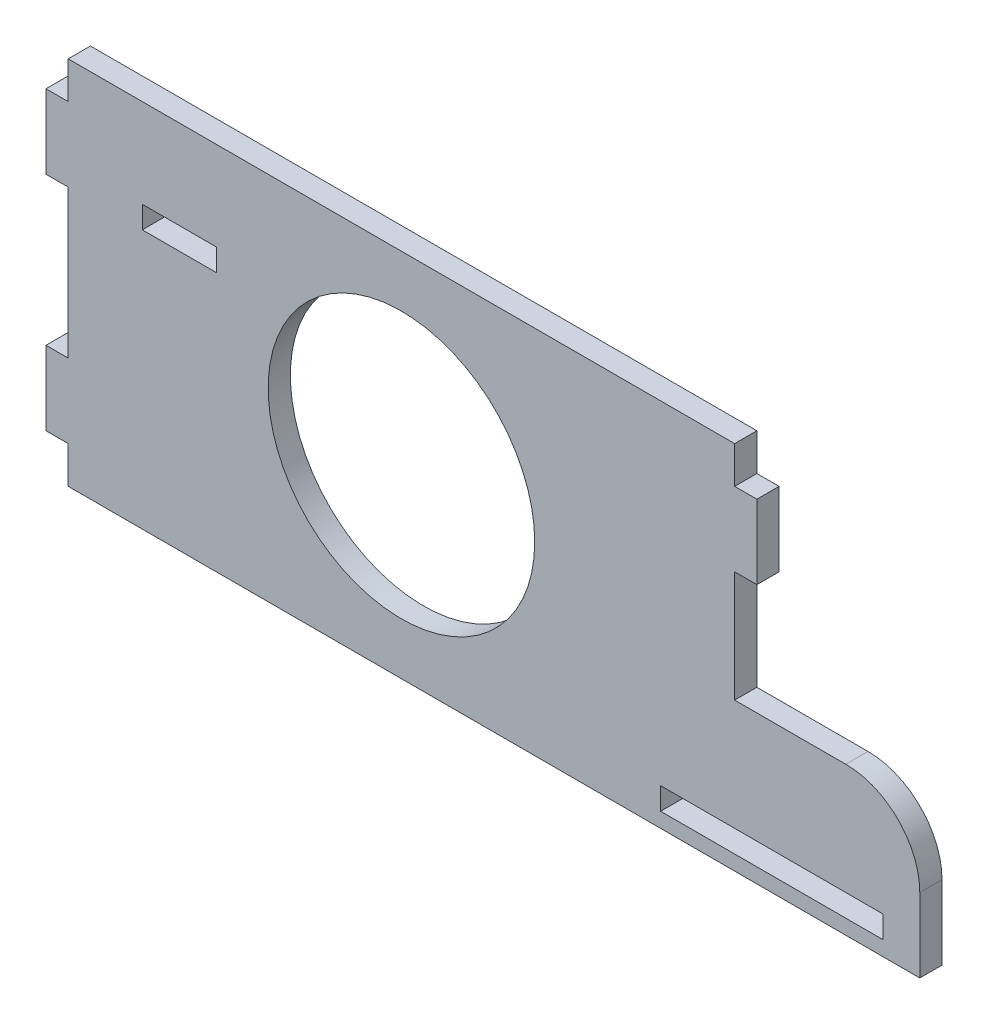
ISO-10303-21;
HEADER;
FILE_DESCRIPTION(('STEP AP214'),'2;1');
FILE_NAME('part.step','',(''),(''),'','','');
FILE_SCHEMA(('AUTOMOTIVE_DESIGN { 1 0 10303 214 1 1 1 1 }'));
ENDSEC;
DATA;
#1=APPLICATION_CONTEXT('core data for automotive mechanical design processes');
#2=APPLICATION_PROTOCOL_DEFINITION('international standard','automotive_design',2000,#1);
#3=PRODUCT_CONTEXT('',#1,'mechanical');
#4=PRODUCT('Part','Part','',(#3));
#5=PRODUCT_RELATED_PRODUCT_CATEGORY('part','',(#4));
#6=PRODUCT_DEFINITION_FORMATION('','',#4);
#7=PRODUCT_DEFINITION_CONTEXT('part definition',#1,'design');
#8=PRODUCT_DEFINITION('design','',#6,#7);
#9=PRODUCT_DEFINITION_SHAPE('','',#8);
#10=(LENGTH_UNIT() NAMED_UNIT(*) SI_UNIT(.MILLI.,.METRE.));
#11=(NAMED_UNIT(*) PLANE_ANGLE_UNIT() SI_UNIT($,.RADIAN.));
#12=(NAMED_UNIT(*) SI_UNIT($,.STERADIAN.) SOLID_ANGLE_UNIT());
#13=UNCERTAINTY_MEASURE_WITH_UNIT(LENGTH_MEASURE(1.E-05),#10,'distance_accuracy_value','');
#14=(GEOMETRIC_REPRESENTATION_CONTEXT(3) GLOBAL_UNCERTAINTY_ASSIGNED_CONTEXT((#13)) GLOBAL_UNIT_ASSIGNED_CONTEXT((#10,
#11,#12)) REPRESENTATION_CONTEXT('',''));
#15=CARTESIAN_POINT('',(0.,0.,0.));
#16=DIRECTION('',(0.,0.,1.));
#17=DIRECTION('',(1.,0.,0.));
#18=AXIS2_PLACEMENT_3D('',#15,#16,#17);
#19=CARTESIAN_POINT('',(60.,-15.,3.));
#20=DIRECTION('',(0.,0.,-1.));
#21=DIRECTION('',(-1.,0.,0.));
#22=AXIS2_PLACEMENT_3D('',#19,#20,#21);
#23=PLANE('',#22);
#24=DIRECTION('',(0.,1.,0.));
#25=VECTOR('',#24,1.);
#26=CARTESIAN_POINT('',(65.,-23.,3.));
#27=LINE('',#26,#25);
#28=CARTESIAN_POINT('',(65.,-23.,3.));
#29=VERTEX_POINT('',#28);
#30=CARTESIAN_POINT('',(65.,-20.,3.));
#31=VERTEX_POINT('',#30);
#32=EDGE_CURVE('E248',#29,#31,#27,.T.);
#33=ORIENTED_EDGE('',*,*,#32,.F.);
#34=DIRECTION('',(1.,0.,0.));
#35=VECTOR('',#34,1.);
#36=CARTESIAN_POINT('',(35.,-23.,3.));
#37=LINE('',#36,#35);
#38=CARTESIAN_POINT('',(35.,-23.,3.));
#39=VERTEX_POINT('',#38);
#40=EDGE_CURVE('E256',#39,#29,#37,.T.);
#41=ORIENTED_EDGE('',*,*,#40,.F.);
#42=DIRECTION('',(0.,-1.,0.));
#43=VECTOR('',#42,1.);
#44=CARTESIAN_POINT('',(35.,-23.,3.));
#45=LINE('',#44,#43);
#46=CARTESIAN_POINT('',(35.,-20.,3.));
#47=VERTEX_POINT('',#46);
#48=EDGE_CURVE('E253',#47,#39,#45,.T.);
#49=ORIENTED_EDGE('',*,*,#48,.F.);
#50=DIRECTION('',(-1.,0.,0.));
#51=VECTOR('',#50,1.);
#52=CARTESIAN_POINT('',(35.,-20.,3.));
#53=LINE('',#52,#51);
#54=EDGE_CURVE('E250',#31,#47,#53,.T.);
#55=ORIENTED_EDGE('',*,*,#54,.F.);
#56=EDGE_LOOP('',(#33,#41,#49,#55));
#57=FACE_BOUND('',#56,.T.);
#58=DIRECTION('',(1.,0.,0.));
#59=VECTOR('',#58,1.);
#60=CARTESIAN_POINT('',(-45.,-25.0000000000001,3.));
#61=LINE('',#60,#59);
#62=CARTESIAN_POINT('',(-45.,-25.0000000000001,3.));
#63=VERTEX_POINT('',#62);
#64=CARTESIAN_POINT('',(70.,-25.,3.));
#65=VERTEX_POINT('',#64);
#66=EDGE_CURVE('E285',#63,#65,#61,.T.);
#67=ORIENTED_EDGE('',*,*,#66,.T.);
#68=DIRECTION('',(0.,1.,0.));
#69=VECTOR('',#68,1.);
#70=CARTESIAN_POINT('',(70.,-14.9999999999999,3.));
#71=LINE('',#70,#69);
#72=CARTESIAN_POINT('',(70.,-14.9999999999999,3.));
#73=VERTEX_POINT('',#72);
#74=EDGE_CURVE('E288',#65,#73,#71,.T.);
#75=ORIENTED_EDGE('',*,*,#74,.T.);
#76=CARTESIAN_POINT('',(60.,-15.,3.));
#77=DIRECTION('',(0.,0.,1.));
#78=DIRECTION('',(-1.,0.,0.));
#79=AXIS2_PLACEMENT_3D('',#76,#77,#78);
#80=CIRCLE('',#79,10.);
#81=CARTESIAN_POINT('',(59.9999999999999,-5.,3.));
#82=VERTEX_POINT('',#81);
#83=EDGE_CURVE('E291',#73,#82,#80,.T.);
#84=ORIENTED_EDGE('',*,*,#83,.T.);
#85=DIRECTION('',(-1.,0.,0.));
#86=VECTOR('',#85,1.);
#87=CARTESIAN_POINT('',(45.,-4.99999999999989,3.));
#88=LINE('',#87,#86);
#89=CARTESIAN_POINT('',(45.,-4.99999999999989,3.));
#90=VERTEX_POINT('',#89);
#91=EDGE_CURVE('E293',#82,#90,#88,.T.);
#92=ORIENTED_EDGE('',*,*,#91,.T.);
#93=DIRECTION('',(0.,1.,0.));
#94=VECTOR('',#93,1.);
#95=CARTESIAN_POINT('',(45.,10.0000000000001,3.));
#96=LINE('',#95,#94);
#97=CARTESIAN_POINT('',(45.,10.0000000000001,3.));
#98=VERTEX_POINT('',#97);
#99=EDGE_CURVE('E295',#90,#98,#96,.T.);
#100=ORIENTED_EDGE('',*,*,#99,.T.);
#101=DIRECTION('',(1.,0.,0.));
#102=VECTOR('',#101,1.);
#103=CARTESIAN_POINT('',(45.,10.0000000000001,3.));
#104=LINE('',#103,#102);
#105=CARTESIAN_POINT('',(48.0000000000001,10.0000000000001,3.));
#106=VERTEX_POINT('',#105);
#107=EDGE_CURVE('E297',#98,#106,#104,.T.);
#108=ORIENTED_EDGE('',*,*,#107,.T.);
#109=DIRECTION('',(0.,1.,0.));
#110=VECTOR('',#109,1.);
#111=CARTESIAN_POINT('',(48.,20.,3.));
#112=LINE('',#111,#110);
#113=CARTESIAN_POINT('',(48.,20.,3.));
#114=VERTEX_POINT('',#113);
#115=EDGE_CURVE('E299',#106,#114,#112,.T.);
#116=ORIENTED_EDGE('',*,*,#115,.T.);
#117=DIRECTION('',(-1.,0.,0.));
#118=VECTOR('',#117,1.);
#119=CARTESIAN_POINT('',(45.,20.,3.));
#120=LINE('',#119,#118);
#121=CARTESIAN_POINT('',(45.,20.,3.));
#122=VERTEX_POINT('',#121);
#123=EDGE_CURVE('E301',#114,#122,#120,.T.);
#124=ORIENTED_EDGE('',*,*,#123,.T.);
#125=DIRECTION('',(0.,1.,0.));
#126=VECTOR('',#125,1.);
#127=CARTESIAN_POINT('',(45.,25.,3.));
#128=LINE('',#127,#126);
#129=CARTESIAN_POINT('',(45.,25.,3.));
#130=VERTEX_POINT('',#129);
#131=EDGE_CURVE('E303',#122,#130,#128,.T.);
#132=ORIENTED_EDGE('',*,*,#131,.T.);
#133=DIRECTION('',(-1.,0.,0.));
#134=VECTOR('',#133,1.);
#135=CARTESIAN_POINT('',(45.,25.,3.));
#136=LINE('',#135,#134);
#137=CARTESIAN_POINT('',(-45.,24.9999999999999,3.));
#138=VERTEX_POINT('',#137);
#139=EDGE_CURVE('E305',#130,#138,#136,.T.);
#140=ORIENTED_EDGE('',*,*,#139,.T.);
#141=DIRECTION('',(0.,-1.,0.));
#142=VECTOR('',#141,1.);
#143=CARTESIAN_POINT('',(-45.,24.9999999999999,3.));
#144=LINE('',#143,#142);
#145=CARTESIAN_POINT('',(-45.,20.,3.));
#146=VERTEX_POINT('',#145);
#147=EDGE_CURVE('E307',#138,#146,#144,.T.);
#148=ORIENTED_EDGE('',*,*,#147,.T.);
#149=DIRECTION('',(-1.,0.,0.));
#150=VECTOR('',#149,1.);
#151=CARTESIAN_POINT('',(-48.,20.,3.));
#152=LINE('',#151,#150);
#153=CARTESIAN_POINT('',(-48.,20.,3.));
#154=VERTEX_POINT('',#153);
#155=EDGE_CURVE('E309',#146,#154,#152,.T.);
#156=ORIENTED_EDGE('',*,*,#155,.T.);
#157=DIRECTION('',(0.,-1.,0.));
#158=VECTOR('',#157,1.);
#159=CARTESIAN_POINT('',(-48.,20.,3.));
#160=LINE('',#159,#158);
#161=CARTESIAN_POINT('',(-48.,10.,3.));
#162=VERTEX_POINT('',#161);
#163=EDGE_CURVE('E311',#154,#162,#160,.T.);
#164=ORIENTED_EDGE('',*,*,#163,.T.);
#165=DIRECTION('',(1.,0.,0.));
#166=VECTOR('',#165,1.);
#167=CARTESIAN_POINT('',(-48.,10.,3.));
#168=LINE('',#167,#166);
#169=CARTESIAN_POINT('',(-45.,10.,3.));
#170=VERTEX_POINT('',#169);
#171=EDGE_CURVE('E313',#162,#170,#168,.T.);
#172=ORIENTED_EDGE('',*,*,#171,.T.);
#173=DIRECTION('',(0.,-1.,0.));
#174=VECTOR('',#173,1.);
#175=CARTESIAN_POINT('',(-45.,10.,3.));
#176=LINE('',#175,#174);
#177=CARTESIAN_POINT('',(-45.,-10.,3.));
#178=VERTEX_POINT('',#177);
#179=EDGE_CURVE('E315',#170,#178,#176,.T.);
#180=ORIENTED_EDGE('',*,*,#179,.T.);
#181=DIRECTION('',(-1.,0.,0.));
#182=VECTOR('',#181,1.);
#183=CARTESIAN_POINT('',(-48.,-10.,3.));
#184=LINE('',#183,#182);
#185=CARTESIAN_POINT('',(-48.,-10.,3.));
#186=VERTEX_POINT('',#185);
#187=EDGE_CURVE('E317',#178,#186,#184,.T.);
#188=ORIENTED_EDGE('',*,*,#187,.T.);
#189=DIRECTION('',(0.,-1.,0.));
#190=VECTOR('',#189,1.);
#191=CARTESIAN_POINT('',(-48.,-10.,3.));
#192=LINE('',#191,#190);
#193=CARTESIAN_POINT('',(-48.,-20.,3.));
#194=VERTEX_POINT('',#193);
#195=EDGE_CURVE('E319',#186,#194,#192,.T.);
#196=ORIENTED_EDGE('',*,*,#195,.T.);
#197=DIRECTION('',(1.,0.,0.));
#198=VECTOR('',#197,1.);
#199=CARTESIAN_POINT('',(-48.,-20.,3.));
#200=LINE('',#199,#198);
#201=CARTESIAN_POINT('',(-45.,-20.,3.));
#202=VERTEX_POINT('',#201);
#203=EDGE_CURVE('E321',#194,#202,#200,.T.);
#204=ORIENTED_EDGE('',*,*,#203,.T.);
#205=DIRECTION('',(0.,-1.,0.));
#206=VECTOR('',#205,1.);
#207=CARTESIAN_POINT('',(-45.,-20.,3.));
#208=LINE('',#207,#206);
#209=EDGE_CURVE('E323',#202,#63,#208,.T.);
#210=ORIENTED_EDGE('',*,*,#209,.T.);
#211=EDGE_LOOP('',(#67,#75,#84,#92,#100,#108,#116,#124,#132,#140,#148,#156,#164,#172,#180,#188,
#196,#204,#210));
#212=FACE_BOUND('',#211,.T.);
#213=CARTESIAN_POINT('',(0.,0.,3.));
#214=DIRECTION('',(0.,0.,1.));
#215=DIRECTION('',(1.,0.,0.));
#216=AXIS2_PLACEMENT_3D('',#213,#214,#215);
#217=CIRCLE('',#216,18.);
#218=CARTESIAN_POINT('',(18.,0.,3.));
#219=VERTEX_POINT('',#218);
#220=EDGE_CURVE('E279',#219,#219,#217,.T.);
#221=ORIENTED_EDGE('',*,*,#220,.F.);
#222=EDGE_LOOP('',(#221));
#223=FACE_BOUND('',#222,.T.);
#224=DIRECTION('',(0.,1.,0.));
#225=VECTOR('',#224,1.);
#226=CARTESIAN_POINT('',(-25.,13.,3.));
#227=LINE('',#226,#225);
#228=CARTESIAN_POINT('',(-25.,10.,3.));
#229=VERTEX_POINT('',#228);
#230=CARTESIAN_POINT('',(-25.,13.,3.));
#231=VERTEX_POINT('',#230);
#232=EDGE_CURVE('E212',#229,#231,#227,.T.);
#233=ORIENTED_EDGE('',*,*,#232,.F.);
#234=DIRECTION('',(1.,0.,0.));
#235=VECTOR('',#234,1.);
#236=CARTESIAN_POINT('',(-35.,10.,3.));
#237=LINE('',#236,#235);
#238=CARTESIAN_POINT('',(-35.,10.,3.));
#239=VERTEX_POINT('',#238);
#240=EDGE_CURVE('E234',#239,#229,#237,.T.);
#241=ORIENTED_EDGE('',*,*,#240,.F.);
#242=DIRECTION('',(0.,-1.,0.));
#243=VECTOR('',#242,1.);
#244=CARTESIAN_POINT('',(-35.,13.,3.));
#245=LINE('',#244,#243);
#246=CARTESIAN_POINT('',(-35.,13.,3.));
#247=VERTEX_POINT('',#246);
#248=EDGE_CURVE('E232',#247,#239,#245,.T.);
#249=ORIENTED_EDGE('',*,*,#248,.F.);
#250=DIRECTION('',(-1.,0.,0.));
#251=VECTOR('',#250,1.);
#252=CARTESIAN_POINT('',(-35.,13.,3.));
#253=LINE('',#252,#251);
#254=EDGE_CURVE('E220',#231,#247,#253,.T.);
#255=ORIENTED_EDGE('',*,*,#254,.F.);
#256=EDGE_LOOP('',(#233,#241,#249,#255));
#257=FACE_BOUND('',#256,.T.);
#258=ADVANCED_FACE('F33',(#57,#212,#223,#257),#23,.F.);
#259=CARTESIAN_POINT('',(60.,-15.,0.));
#260=DIRECTION('',(0.,0.,-1.));
#261=DIRECTION('',(-1.,0.,0.));
#262=AXIS2_PLACEMENT_3D('',#259,#260,#261);
#263=PLANE('',#262);
#264=DIRECTION('',(1.,0.,0.));
#265=VECTOR('',#264,1.);
#266=CARTESIAN_POINT('',(-45.,-25.0000000000001,0.));
#267=LINE('',#266,#265);
#268=CARTESIAN_POINT('',(-45.,-25.0000000000001,0.));
#269=VERTEX_POINT('',#268);
#270=CARTESIAN_POINT('',(70.,-25.,0.));
#271=VERTEX_POINT('',#270);
#272=EDGE_CURVE('E282',#269,#271,#267,.T.);
#273=ORIENTED_EDGE('',*,*,#272,.F.);
#274=DIRECTION('',(0.,-1.,0.));
#275=VECTOR('',#274,1.);
#276=CARTESIAN_POINT('',(-45.,-20.,0.));
#277=LINE('',#276,#275);
#278=CARTESIAN_POINT('',(-45.,-20.,0.));
#279=VERTEX_POINT('',#278);
#280=EDGE_CURVE('E289',#279,#269,#277,.T.);
#281=ORIENTED_EDGE('',*,*,#280,.F.);
#282=DIRECTION('',(1.,0.,0.));
#283=VECTOR('',#282,1.);
#284=CARTESIAN_POINT('',(-48.,-20.,0.));
#285=LINE('',#284,#283);
#286=CARTESIAN_POINT('',(-48.,-20.,0.));
#287=VERTEX_POINT('',#286);
#288=EDGE_CURVE('E360',#287,#279,#285,.T.);
#289=ORIENTED_EDGE('',*,*,#288,.F.);
#290=DIRECTION('',(0.,-1.,0.));
#291=VECTOR('',#290,1.);
#292=CARTESIAN_POINT('',(-48.,-10.,0.));
#293=LINE('',#292,#291);
#294=CARTESIAN_POINT('',(-48.,-10.,0.));
#295=VERTEX_POINT('',#294);
#296=EDGE_CURVE('E358',#295,#287,#293,.T.);
#297=ORIENTED_EDGE('',*,*,#296,.F.);
#298=DIRECTION('',(-1.,0.,0.));
#299=VECTOR('',#298,1.);
#300=CARTESIAN_POINT('',(-48.,-10.,0.));
#301=LINE('',#300,#299);
#302=CARTESIAN_POINT('',(-45.,-10.,0.));
#303=VERTEX_POINT('',#302);
#304=EDGE_CURVE('E356',#303,#295,#301,.T.);
#305=ORIENTED_EDGE('',*,*,#304,.F.);
#306=DIRECTION('',(0.,-1.,0.));
#307=VECTOR('',#306,1.);
#308=CARTESIAN_POINT('',(-45.,10.,0.));
#309=LINE('',#308,#307);
#310=CARTESIAN_POINT('',(-45.,10.,0.));
#311=VERTEX_POINT('',#310);
#312=EDGE_CURVE('E354',#311,#303,#309,.T.);
#313=ORIENTED_EDGE('',*,*,#312,.F.);
#314=DIRECTION('',(1.,0.,0.));
#315=VECTOR('',#314,1.);
#316=CARTESIAN_POINT('',(-48.,10.,0.));
#317=LINE('',#316,#315);
#318=CARTESIAN_POINT('',(-48.,10.,0.));
#319=VERTEX_POINT('',#318);
#320=EDGE_CURVE('E352',#319,#311,#317,.T.);
#321=ORIENTED_EDGE('',*,*,#320,.F.);
#322=DIRECTION('',(0.,-1.,0.));
#323=VECTOR('',#322,1.);
#324=CARTESIAN_POINT('',(-48.,20.,0.));
#325=LINE('',#324,#323);
#326=CARTESIAN_POINT('',(-48.,20.,0.));
#327=VERTEX_POINT('',#326);
#328=EDGE_CURVE('E350',#327,#319,#325,.T.);
#329=ORIENTED_EDGE('',*,*,#328,.F.);
#330=DIRECTION('',(-1.,0.,0.));
#331=VECTOR('',#330,1.);
#332=CARTESIAN_POINT('',(-48.,20.,0.));
#333=LINE('',#332,#331);
#334=CARTESIAN_POINT('',(-45.,20.,0.));
#335=VERTEX_POINT('',#334);
#336=EDGE_CURVE('E348',#335,#327,#333,.T.);
#337=ORIENTED_EDGE('',*,*,#336,.F.);
#338=DIRECTION('',(0.,-1.,0.));
#339=VECTOR('',#338,1.);
#340=CARTESIAN_POINT('',(-45.,24.9999999999999,0.));
#341=LINE('',#340,#339);
#342=CARTESIAN_POINT('',(-45.,24.9999999999999,0.));
#343=VERTEX_POINT('',#342);
#344=EDGE_CURVE('E346',#343,#335,#341,.T.);
#345=ORIENTED_EDGE('',*,*,#344,.F.);
#346=DIRECTION('',(-1.,0.,0.));
#347=VECTOR('',#346,1.);
#348=CARTESIAN_POINT('',(45.,25.,0.));
#349=LINE('',#348,#347);
#350=CARTESIAN_POINT('',(45.,25.,0.));
#351=VERTEX_POINT('',#350);
#352=EDGE_CURVE('E344',#351,#343,#349,.T.);
#353=ORIENTED_EDGE('',*,*,#352,.F.);
#354=DIRECTION('',(0.,1.,0.));
#355=VECTOR('',#354,1.);
#356=CARTESIAN_POINT('',(45.,25.,0.));
#357=LINE('',#356,#355);
#358=CARTESIAN_POINT('',(45.,20.,0.));
#359=VERTEX_POINT('',#358);
#360=EDGE_CURVE('E342',#359,#351,#357,.T.);
#361=ORIENTED_EDGE('',*,*,#360,.F.);
#362=DIRECTION('',(-1.,0.,0.));
#363=VECTOR('',#362,1.);
#364=CARTESIAN_POINT('',(45.,20.,0.));
#365=LINE('',#364,#363);
#366=CARTESIAN_POINT('',(48.,20.,0.));
#367=VERTEX_POINT('',#366);
#368=EDGE_CURVE('E340',#367,#359,#365,.T.);
#369=ORIENTED_EDGE('',*,*,#368,.F.);
#370=DIRECTION('',(0.,1.,0.));
#371=VECTOR('',#370,1.);
#372=CARTESIAN_POINT('',(48.,20.,0.));
#373=LINE('',#372,#371);
#374=CARTESIAN_POINT('',(48.0000000000001,10.0000000000001,0.));
#375=VERTEX_POINT('',#374);
#376=EDGE_CURVE('E338',#375,#367,#373,.T.);
#377=ORIENTED_EDGE('',*,*,#376,.F.);
#378=DIRECTION('',(1.,0.,0.));
#379=VECTOR('',#378,1.);
#380=CARTESIAN_POINT('',(45.,10.0000000000001,0.));
#381=LINE('',#380,#379);
#382=CARTESIAN_POINT('',(45.,10.0000000000001,0.));
#383=VERTEX_POINT('',#382);
#384=EDGE_CURVE('E336',#383,#375,#381,.T.);
#385=ORIENTED_EDGE('',*,*,#384,.F.);
#386=DIRECTION('',(0.,1.,0.));
#387=VECTOR('',#386,1.);
#388=CARTESIAN_POINT('',(45.,10.0000000000001,0.));
#389=LINE('',#388,#387);
#390=CARTESIAN_POINT('',(45.,-4.99999999999989,0.));
#391=VERTEX_POINT('',#390);
#392=EDGE_CURVE('E334',#391,#383,#389,.T.);
#393=ORIENTED_EDGE('',*,*,#392,.F.);
#394=DIRECTION('',(-1.,0.,0.));
#395=VECTOR('',#394,1.);
#396=CARTESIAN_POINT('',(45.,-4.99999999999989,0.));
#397=LINE('',#396,#395);
#398=CARTESIAN_POINT('',(59.9999999999999,-5.,0.));
#399=VERTEX_POINT('',#398);
#400=EDGE_CURVE('E332',#399,#391,#397,.T.);
#401=ORIENTED_EDGE('',*,*,#400,.F.);
#402=CARTESIAN_POINT('',(60.,-15.,0.));
#403=DIRECTION('',(0.,0.,1.));
#404=DIRECTION('',(-1.,0.,0.));
#405=AXIS2_PLACEMENT_3D('',#402,#403,#404);
#406=CIRCLE('',#405,10.);
#407=CARTESIAN_POINT('',(70.,-14.9999999999999,0.));
#408=VERTEX_POINT('',#407);
#409=EDGE_CURVE('E330',#408,#399,#406,.T.);
#410=ORIENTED_EDGE('',*,*,#409,.F.);
#411=DIRECTION('',(0.,1.,0.));
#412=VECTOR('',#411,1.);
#413=CARTESIAN_POINT('',(70.,-14.9999999999999,0.));
#414=LINE('',#413,#412);
#415=EDGE_CURVE('E328',#271,#408,#414,.T.);
#416=ORIENTED_EDGE('',*,*,#415,.F.);
#417=EDGE_LOOP('',(#273,#281,#289,#297,#305,#313,#321,#329,#337,#345,#353,#361,#369,#377,#385,
#393,#401,#410,#416));
#418=FACE_BOUND('',#417,.T.);
#419=CARTESIAN_POINT('',(0.,0.,0.));
#420=DIRECTION('',(0.,0.,1.));
#421=DIRECTION('',(1.,0.,0.));
#422=AXIS2_PLACEMENT_3D('',#419,#420,#421);
#423=CIRCLE('',#422,18.);
#424=CARTESIAN_POINT('',(18.,0.,0.));
#425=VERTEX_POINT('',#424);
#426=EDGE_CURVE('E278',#425,#425,#423,.T.);
#427=ORIENTED_EDGE('',*,*,#426,.T.);
#428=EDGE_LOOP('',(#427));
#429=FACE_BOUND('',#428,.T.);
#430=DIRECTION('',(1.,0.,0.));
#431=VECTOR('',#430,1.);
#432=CARTESIAN_POINT('',(35.,-23.,0.));
#433=LINE('',#432,#431);
#434=CARTESIAN_POINT('',(35.,-23.,0.));
#435=VERTEX_POINT('',#434);
#436=CARTESIAN_POINT('',(65.,-23.,0.));
#437=VERTEX_POINT('',#436);
#438=EDGE_CURVE('E251',#435,#437,#433,.T.);
#439=ORIENTED_EDGE('',*,*,#438,.T.);
#440=DIRECTION('',(0.,1.,0.));
#441=VECTOR('',#440,1.);
#442=CARTESIAN_POINT('',(65.,-23.,0.));
#443=LINE('',#442,#441);
#444=CARTESIAN_POINT('',(65.,-20.,0.));
#445=VERTEX_POINT('',#444);
#446=EDGE_CURVE('E228',#437,#445,#443,.T.);
#447=ORIENTED_EDGE('',*,*,#446,.T.);
#448=DIRECTION('',(-1.,0.,0.));
#449=VECTOR('',#448,1.);
#450=CARTESIAN_POINT('',(35.,-20.,0.));
#451=LINE('',#450,#449);
#452=CARTESIAN_POINT('',(35.,-20.,0.));
#453=VERTEX_POINT('',#452);
#454=EDGE_CURVE('E261',#445,#453,#451,.T.);
#455=ORIENTED_EDGE('',*,*,#454,.T.);
#456=DIRECTION('',(0.,-1.,0.));
#457=VECTOR('',#456,1.);
#458=CARTESIAN_POINT('',(35.,-23.,0.));
#459=LINE('',#458,#457);
#460=EDGE_CURVE('E264',#453,#435,#459,.T.);
#461=ORIENTED_EDGE('',*,*,#460,.T.);
#462=EDGE_LOOP('',(#439,#447,#455,#461));
#463=FACE_BOUND('',#462,.T.);
#464=DIRECTION('',(1.,0.,0.));
#465=VECTOR('',#464,1.);
#466=CARTESIAN_POINT('',(-35.,10.,0.));
#467=LINE('',#466,#465);
#468=CARTESIAN_POINT('',(-35.,10.,0.));
#469=VERTEX_POINT('',#468);
#470=CARTESIAN_POINT('',(-25.,10.,0.));
#471=VERTEX_POINT('',#470);
#472=EDGE_CURVE('E221',#469,#471,#467,.T.);
#473=ORIENTED_EDGE('',*,*,#472,.T.);
#474=DIRECTION('',(0.,1.,0.));
#475=VECTOR('',#474,1.);
#476=CARTESIAN_POINT('',(-25.,13.,0.));
#477=LINE('',#476,#475);
#478=CARTESIAN_POINT('',(-25.,13.,0.));
#479=VERTEX_POINT('',#478);
#480=EDGE_CURVE('E56',#471,#479,#477,.T.);
#481=ORIENTED_EDGE('',*,*,#480,.T.);
#482=DIRECTION('',(-1.,0.,0.));
#483=VECTOR('',#482,1.);
#484=CARTESIAN_POINT('',(-35.,13.,0.));
#485=LINE('',#484,#483);
#486=CARTESIAN_POINT('',(-35.,13.,0.));
#487=VERTEX_POINT('',#486);
#488=EDGE_CURVE('E227',#479,#487,#485,.T.);
#489=ORIENTED_EDGE('',*,*,#488,.T.);
#490=DIRECTION('',(0.,-1.,0.));
#491=VECTOR('',#490,1.);
#492=CARTESIAN_POINT('',(-35.,13.,0.));
#493=LINE('',#492,#491);
#494=EDGE_CURVE('E240',#487,#469,#493,.T.);
#495=ORIENTED_EDGE('',*,*,#494,.T.);
#496=EDGE_LOOP('',(#473,#481,#489,#495));
#497=FACE_BOUND('',#496,.T.);
#498=ADVANCED_FACE('F423',(#418,#429,#463,#497),#263,.T.);
#499=CARTESIAN_POINT('',(-45.,-25.0000000000001,3.));
#500=DIRECTION('',(0.,1.,0.));
#501=DIRECTION('',(-1.,0.,0.));
#502=AXIS2_PLACEMENT_3D('',#499,#500,#501);
#503=PLANE('',#502);
#504=ORIENTED_EDGE('',*,*,#272,.T.);
#505=DIRECTION('',(0.,0.,-1.));
#506=VECTOR('',#505,1.);
#507=CARTESIAN_POINT('',(70.,-25.,3.));
#508=LINE('',#507,#506);
#509=EDGE_CURVE('E11',#65,#271,#508,.T.);
#510=ORIENTED_EDGE('',*,*,#509,.F.);
#511=ORIENTED_EDGE('',*,*,#66,.F.);
#512=DIRECTION('',(0.,0.,-1.));
#513=VECTOR('',#512,1.);
#514=CARTESIAN_POINT('',(-45.,-25.0000000000001,3.));
#515=LINE('',#514,#513);
#516=EDGE_CURVE('E325',#63,#269,#515,.T.);
#517=ORIENTED_EDGE('',*,*,#516,.T.);
#518=EDGE_LOOP('',(#504,#510,#511,#517));
#519=FACE_BOUND('',#518,.T.);
#520=ADVANCED_FACE('F35',(#519),#503,.F.);
#521=CARTESIAN_POINT('',(70.,-14.9999999999999,3.));
#522=DIRECTION('',(-1.,0.,0.));
#523=DIRECTION('',(0.,-1.,0.));
#524=AXIS2_PLACEMENT_3D('',#521,#522,#523);
#525=PLANE('',#524);
#526=ORIENTED_EDGE('',*,*,#415,.T.);
#527=DIRECTION('',(0.,0.,-1.));
#528=VECTOR('',#527,1.);
#529=CARTESIAN_POINT('',(70.,-14.9999999999999,3.));
#530=LINE('',#529,#528);
#531=EDGE_CURVE('E41',#73,#408,#530,.T.);
#532=ORIENTED_EDGE('',*,*,#531,.F.);
#533=ORIENTED_EDGE('',*,*,#74,.F.);
#534=ORIENTED_EDGE('',*,*,#509,.T.);
#535=EDGE_LOOP('',(#526,#532,#533,#534));
#536=FACE_BOUND('',#535,.T.);
#537=ADVANCED_FACE('F441',(#536),#525,.F.);
#538=CARTESIAN_POINT('',(60.,-15.,3.));
#539=DIRECTION('',(0.,0.,-1.));
#540=DIRECTION('',(-1.,0.,0.));
#541=AXIS2_PLACEMENT_3D('',#538,#539,#540);
#542=CYLINDRICAL_SURFACE('',#541,10.);
#543=ORIENTED_EDGE('',*,*,#409,.T.);
#544=DIRECTION('',(0.,0.,-1.));
#545=VECTOR('',#544,1.);
#546=CARTESIAN_POINT('',(59.9999999999999,-5.,3.));
#547=LINE('',#546,#545);
#548=EDGE_CURVE('E410',#82,#399,#547,.T.);
#549=ORIENTED_EDGE('',*,*,#548,.F.);
#550=ORIENTED_EDGE('',*,*,#83,.F.);
#551=ORIENTED_EDGE('',*,*,#531,.T.);
#552=EDGE_LOOP('',(#543,#549,#550,#551));
#553=FACE_BOUND('',#552,.T.);
#554=ADVANCED_FACE('F417',(#553),#542,.T.);
#555=CARTESIAN_POINT('',(45.,-4.99999999999989,3.));
#556=DIRECTION('',(0.,-1.,0.));
#557=DIRECTION('',(1.,0.,0.));
#558=AXIS2_PLACEMENT_3D('',#555,#556,#557);
#559=PLANE('',#558);
#560=ORIENTED_EDGE('',*,*,#400,.T.);
#561=DIRECTION('',(0.,0.,-1.));
#562=VECTOR('',#561,1.);
#563=CARTESIAN_POINT('',(45.,-4.99999999999989,3.));
#564=LINE('',#563,#562);
#565=EDGE_CURVE('E407',#90,#391,#564,.T.);
#566=ORIENTED_EDGE('',*,*,#565,.F.);
#567=ORIENTED_EDGE('',*,*,#91,.F.);
#568=ORIENTED_EDGE('',*,*,#548,.T.);
#569=EDGE_LOOP('',(#560,#566,#567,#568));
#570=FACE_BOUND('',#569,.T.);
#571=ADVANCED_FACE('F429',(#570),#559,.F.);
#572=CARTESIAN_POINT('',(45.,10.0000000000001,3.));
#573=DIRECTION('',(-1.,0.,0.));
#574=DIRECTION('',(0.,0.,1.));
#575=AXIS2_PLACEMENT_3D('',#572,#573,#574);
#576=PLANE('',#575);
#577=ORIENTED_EDGE('',*,*,#392,.T.);
#578=DIRECTION('',(0.,0.,-1.));
#579=VECTOR('',#578,1.);
#580=CARTESIAN_POINT('',(45.,10.0000000000001,3.));
#581=LINE('',#580,#579);
#582=EDGE_CURVE('E404',#98,#383,#581,.T.);
#583=ORIENTED_EDGE('',*,*,#582,.F.);
#584=ORIENTED_EDGE('',*,*,#99,.F.);
#585=ORIENTED_EDGE('',*,*,#565,.T.);
#586=EDGE_LOOP('',(#577,#583,#584,#585));
#587=FACE_BOUND('',#586,.T.);
#588=ADVANCED_FACE('F433',(#587),#576,.F.);
#589=CARTESIAN_POINT('',(45.,10.0000000000001,3.));
#590=DIRECTION('',(0.,1.,0.));
#591=DIRECTION('',(-1.,0.,0.));
#592=AXIS2_PLACEMENT_3D('',#589,#590,#591);
#593=PLANE('',#592);
#594=ORIENTED_EDGE('',*,*,#384,.T.);
#595=DIRECTION('',(0.,0.,-1.));
#596=VECTOR('',#595,1.);
#597=CARTESIAN_POINT('',(48.0000000000001,10.0000000000001,3.));
#598=LINE('',#597,#596);
#599=EDGE_CURVE('E401',#106,#375,#598,.T.);
#600=ORIENTED_EDGE('',*,*,#599,.F.);
#601=ORIENTED_EDGE('',*,*,#107,.F.);
#602=ORIENTED_EDGE('',*,*,#582,.T.);
#603=EDGE_LOOP('',(#594,#600,#601,#602));
#604=FACE_BOUND('',#603,.T.);
#605=ADVANCED_FACE('F509',(#604),#593,.F.);
#606=CARTESIAN_POINT('',(48.,20.,3.));
#607=DIRECTION('',(-1.,0.,0.));
#608=DIRECTION('',(0.,-1.,0.));
#609=AXIS2_PLACEMENT_3D('',#606,#607,#608);
#610=PLANE('',#609);
#611=ORIENTED_EDGE('',*,*,#376,.T.);
#612=DIRECTION('',(0.,0.,-1.));
#613=VECTOR('',#612,1.);
#614=CARTESIAN_POINT('',(48.,20.,3.));
#615=LINE('',#614,#613);
#616=EDGE_CURVE('E398',#114,#367,#615,.T.);
#617=ORIENTED_EDGE('',*,*,#616,.F.);
#618=ORIENTED_EDGE('',*,*,#115,.F.);
#619=ORIENTED_EDGE('',*,*,#599,.T.);
#620=EDGE_LOOP('',(#611,#617,#618,#619));
#621=FACE_BOUND('',#620,.T.);
#622=ADVANCED_FACE('F506',(#621),#610,.F.);
#623=CARTESIAN_POINT('',(45.,20.,3.));
#624=DIRECTION('',(0.,-1.,0.));
#625=DIRECTION('',(0.,0.,-1.));
#626=AXIS2_PLACEMENT_3D('',#623,#624,#625);
#627=PLANE('',#626);
#628=ORIENTED_EDGE('',*,*,#368,.T.);
#629=DIRECTION('',(0.,0.,-1.));
#630=VECTOR('',#629,1.);
#631=CARTESIAN_POINT('',(45.,20.,3.));
#632=LINE('',#631,#630);
#633=EDGE_CURVE('E395',#122,#359,#632,.T.);
#634=ORIENTED_EDGE('',*,*,#633,.F.);
#635=ORIENTED_EDGE('',*,*,#123,.F.);
#636=ORIENTED_EDGE('',*,*,#616,.T.);
#637=EDGE_LOOP('',(#628,#634,#635,#636));
#638=FACE_BOUND('',#637,.T.);
#639=ADVANCED_FACE('F502',(#638),#627,.F.);
#640=CARTESIAN_POINT('',(45.,25.,3.));
#641=DIRECTION('',(-1.,0.,0.));
#642=DIRECTION('',(0.,0.,1.));
#643=AXIS2_PLACEMENT_3D('',#640,#641,#642);
#644=PLANE('',#643);
#645=ORIENTED_EDGE('',*,*,#360,.T.);
#646=DIRECTION('',(0.,0.,-1.));
#647=VECTOR('',#646,1.);
#648=CARTESIAN_POINT('',(45.,25.,3.));
#649=LINE('',#648,#647);
#650=EDGE_CURVE('E392',#130,#351,#649,.T.);
#651=ORIENTED_EDGE('',*,*,#650,.F.);
#652=ORIENTED_EDGE('',*,*,#131,.F.);
#653=ORIENTED_EDGE('',*,*,#633,.T.);
#654=EDGE_LOOP('',(#645,#651,#652,#653));
#655=FACE_BOUND('',#654,.T.);
#656=ADVANCED_FACE('F498',(#655),#644,.F.);
#657=CARTESIAN_POINT('',(45.,25.,3.));
#658=DIRECTION('',(0.,-1.,0.));
#659=DIRECTION('',(1.,0.,0.));
#660=AXIS2_PLACEMENT_3D('',#657,#658,#659);
#661=PLANE('',#660);
#662=ORIENTED_EDGE('',*,*,#352,.T.);
#663=DIRECTION('',(0.,0.,-1.));
#664=VECTOR('',#663,1.);
#665=CARTESIAN_POINT('',(-45.,24.9999999999999,3.));
#666=LINE('',#665,#664);
#667=EDGE_CURVE('E389',#138,#343,#666,.T.);
#668=ORIENTED_EDGE('',*,*,#667,.F.);
#669=ORIENTED_EDGE('',*,*,#139,.F.);
#670=ORIENTED_EDGE('',*,*,#650,.T.);
#671=EDGE_LOOP('',(#662,#668,#669,#670));
#672=FACE_BOUND('',#671,.T.);
#673=ADVANCED_FACE('F493',(#672),#661,.F.);
#674=CARTESIAN_POINT('',(-45.,24.9999999999999,3.));
#675=DIRECTION('',(1.,0.,0.));
#676=DIRECTION('',(0.,0.,-1.));
#677=AXIS2_PLACEMENT_3D('',#674,#675,#676);
#678=PLANE('',#677);
#679=ORIENTED_EDGE('',*,*,#344,.T.);
#680=DIRECTION('',(0.,0.,-1.));
#681=VECTOR('',#680,1.);
#682=CARTESIAN_POINT('',(-45.,20.,3.));
#683=LINE('',#682,#681);
#684=EDGE_CURVE('E386',#146,#335,#683,.T.);
#685=ORIENTED_EDGE('',*,*,#684,.F.);
#686=ORIENTED_EDGE('',*,*,#147,.F.);
#687=ORIENTED_EDGE('',*,*,#667,.T.);
#688=EDGE_LOOP('',(#679,#685,#686,#687));
#689=FACE_BOUND('',#688,.T.);
#690=ADVANCED_FACE('F487',(#689),#678,.F.);
#691=CARTESIAN_POINT('',(-48.,20.,3.));
#692=DIRECTION('',(0.,-1.,0.));
#693=DIRECTION('',(0.,0.,-1.));
#694=AXIS2_PLACEMENT_3D('',#691,#692,#693);
#695=PLANE('',#694);
#696=ORIENTED_EDGE('',*,*,#336,.T.);
#697=DIRECTION('',(0.,0.,-1.));
#698=VECTOR('',#697,1.);
#699=CARTESIAN_POINT('',(-48.,20.,3.));
#700=LINE('',#699,#698);
#701=EDGE_CURVE('E383',#154,#327,#700,.T.);
#702=ORIENTED_EDGE('',*,*,#701,.F.);
#703=ORIENTED_EDGE('',*,*,#155,.F.);
#704=ORIENTED_EDGE('',*,*,#684,.T.);
#705=EDGE_LOOP('',(#696,#702,#703,#704));
#706=FACE_BOUND('',#705,.T.);
#707=ADVANCED_FACE('F483',(#706),#695,.F.);
#708=CARTESIAN_POINT('',(-48.,20.,3.));
#709=DIRECTION('',(1.,0.,0.));
#710=DIRECTION('',(0.,0.,-1.));
#711=AXIS2_PLACEMENT_3D('',#708,#709,#710);
#712=PLANE('',#711);
#713=ORIENTED_EDGE('',*,*,#328,.T.);
#714=DIRECTION('',(0.,0.,-1.));
#715=VECTOR('',#714,1.);
#716=CARTESIAN_POINT('',(-48.,10.,3.));
#717=LINE('',#716,#715);
#718=EDGE_CURVE('E380',#162,#319,#717,.T.);
#719=ORIENTED_EDGE('',*,*,#718,.F.);
#720=ORIENTED_EDGE('',*,*,#163,.F.);
#721=ORIENTED_EDGE('',*,*,#701,.T.);
#722=EDGE_LOOP('',(#713,#719,#720,#721));
#723=FACE_BOUND('',#722,.T.);
#724=ADVANCED_FACE('F478',(#723),#712,.F.);
#725=CARTESIAN_POINT('',(-48.,10.,3.));
#726=DIRECTION('',(0.,1.,0.));
#727=DIRECTION('',(0.,0.,1.));
#728=AXIS2_PLACEMENT_3D('',#725,#726,#727);
#729=PLANE('',#728);
#730=ORIENTED_EDGE('',*,*,#320,.T.);
#731=DIRECTION('',(0.,0.,-1.));
#732=VECTOR('',#731,1.);
#733=CARTESIAN_POINT('',(-45.,10.,3.));
#734=LINE('',#733,#732);
#735=EDGE_CURVE('E377',#170,#311,#734,.T.);
#736=ORIENTED_EDGE('',*,*,#735,.F.);
#737=ORIENTED_EDGE('',*,*,#171,.F.);
#738=ORIENTED_EDGE('',*,*,#718,.T.);
#739=EDGE_LOOP('',(#730,#736,#737,#738));
#740=FACE_BOUND('',#739,.T.);
#741=ADVANCED_FACE('F472',(#740),#729,.F.);
#742=CARTESIAN_POINT('',(-45.,10.,3.));
#743=DIRECTION('',(1.,0.,0.));
#744=DIRECTION('',(0.,1.,0.));
#745=AXIS2_PLACEMENT_3D('',#742,#743,#744);
#746=PLANE('',#745);
#747=ORIENTED_EDGE('',*,*,#312,.T.);
#748=DIRECTION('',(0.,0.,-1.));
#749=VECTOR('',#748,1.);
#750=CARTESIAN_POINT('',(-45.,-10.,3.));
#751=LINE('',#750,#749);
#752=EDGE_CURVE('E374',#178,#303,#751,.T.);
#753=ORIENTED_EDGE('',*,*,#752,.F.);
#754=ORIENTED_EDGE('',*,*,#179,.F.);
#755=ORIENTED_EDGE('',*,*,#735,.T.);
#756=EDGE_LOOP('',(#747,#753,#754,#755));
#757=FACE_BOUND('',#756,.T.);
#758=ADVANCED_FACE('F468',(#757),#746,.F.);
#759=CARTESIAN_POINT('',(-48.,-10.,3.));
#760=DIRECTION('',(0.,-1.,0.));
#761=DIRECTION('',(0.,0.,-1.));
#762=AXIS2_PLACEMENT_3D('',#759,#760,#761);
#763=PLANE('',#762);
#764=ORIENTED_EDGE('',*,*,#304,.T.);
#765=DIRECTION('',(0.,0.,-1.));
#766=VECTOR('',#765,1.);
#767=CARTESIAN_POINT('',(-48.,-10.,3.));
#768=LINE('',#767,#766);
#769=EDGE_CURVE('E371',#186,#295,#768,.T.);
#770=ORIENTED_EDGE('',*,*,#769,.F.);
#771=ORIENTED_EDGE('',*,*,#187,.F.);
#772=ORIENTED_EDGE('',*,*,#752,.T.);
#773=EDGE_LOOP('',(#764,#770,#771,#772));
#774=FACE_BOUND('',#773,.T.);
#775=ADVANCED_FACE('F463',(#774),#763,.F.);
#776=CARTESIAN_POINT('',(-48.,-10.,3.));
#777=DIRECTION('',(1.,0.,0.));
#778=DIRECTION('',(0.,0.,-1.));
#779=AXIS2_PLACEMENT_3D('',#776,#777,#778);
#780=PLANE('',#779);
#781=ORIENTED_EDGE('',*,*,#296,.T.);
#782=DIRECTION('',(0.,0.,-1.));
#783=VECTOR('',#782,1.);
#784=CARTESIAN_POINT('',(-48.,-20.,3.));
#785=LINE('',#784,#783);
#786=EDGE_CURVE('E368',#194,#287,#785,.T.);
#787=ORIENTED_EDGE('',*,*,#786,.F.);
#788=ORIENTED_EDGE('',*,*,#195,.F.);
#789=ORIENTED_EDGE('',*,*,#769,.T.);
#790=EDGE_LOOP('',(#781,#787,#788,#789));
#791=FACE_BOUND('',#790,.T.);
#792=ADVANCED_FACE('F457',(#791),#780,.F.);
#793=CARTESIAN_POINT('',(-48.,-20.,3.));
#794=DIRECTION('',(0.,1.,0.));
#795=DIRECTION('',(0.,0.,1.));
#796=AXIS2_PLACEMENT_3D('',#793,#794,#795);
#797=PLANE('',#796);
#798=ORIENTED_EDGE('',*,*,#288,.T.);
#799=DIRECTION('',(0.,0.,-1.));
#800=VECTOR('',#799,1.);
#801=CARTESIAN_POINT('',(-45.,-20.,3.));
#802=LINE('',#801,#800);
#803=EDGE_CURVE('E365',#202,#279,#802,.T.);
#804=ORIENTED_EDGE('',*,*,#803,.F.);
#805=ORIENTED_EDGE('',*,*,#203,.F.);
#806=ORIENTED_EDGE('',*,*,#786,.T.);
#807=EDGE_LOOP('',(#798,#804,#805,#806));
#808=FACE_BOUND('',#807,.T.);
#809=ADVANCED_FACE('F453',(#808),#797,.F.);
#810=CARTESIAN_POINT('',(-45.,-20.,3.));
#811=DIRECTION('',(1.,0.,0.));
#812=DIRECTION('',(0.,0.,-1.));
#813=AXIS2_PLACEMENT_3D('',#810,#811,#812);
#814=PLANE('',#813);
#815=ORIENTED_EDGE('',*,*,#280,.T.);
#816=ORIENTED_EDGE('',*,*,#516,.F.);
#817=ORIENTED_EDGE('',*,*,#209,.F.);
#818=ORIENTED_EDGE('',*,*,#803,.T.);
#819=EDGE_LOOP('',(#815,#816,#817,#818));
#820=FACE_BOUND('',#819,.T.);
#821=ADVANCED_FACE('F448',(#820),#814,.F.);
#822=CARTESIAN_POINT('',(0.,0.,3.));
#823=DIRECTION('',(0.,0.,-1.));
#824=DIRECTION('',(-1.,0.,0.));
#825=AXIS2_PLACEMENT_3D('',#822,#823,#824);
#826=CYLINDRICAL_SURFACE('',#825,18.);
#827=ORIENTED_EDGE('',*,*,#220,.T.);
#828=EDGE_LOOP('',(#827));
#829=FACE_BOUND('',#828,.T.);
#830=ORIENTED_EDGE('',*,*,#426,.F.);
#831=EDGE_LOOP('',(#830));
#832=FACE_BOUND('',#831,.T.);
#833=ADVANCED_FACE('F527',(#829,#832),#826,.F.);
#834=CARTESIAN_POINT('',(65.,-23.,3.));
#835=DIRECTION('',(-1.,0.,0.));
#836=DIRECTION('',(0.,0.,1.));
#837=AXIS2_PLACEMENT_3D('',#834,#835,#836);
#838=PLANE('',#837);
#839=ORIENTED_EDGE('',*,*,#446,.F.);
#840=DIRECTION('',(0.,0.,-1.));
#841=VECTOR('',#840,1.);
#842=CARTESIAN_POINT('',(65.,-23.,3.));
#843=LINE('',#842,#841);
#844=EDGE_CURVE('E258',#29,#437,#843,.T.);
#845=ORIENTED_EDGE('',*,*,#844,.F.);
#846=ORIENTED_EDGE('',*,*,#32,.T.);
#847=DIRECTION('',(0.,0.,-1.));
#848=VECTOR('',#847,1.);
#849=CARTESIAN_POINT('',(65.,-20.,3.));
#850=LINE('',#849,#848);
#851=EDGE_CURVE('E275',#31,#445,#850,.T.);
#852=ORIENTED_EDGE('',*,*,#851,.T.);
#853=EDGE_LOOP('',(#839,#845,#846,#852));
#854=FACE_BOUND('',#853,.T.);
#855=ADVANCED_FACE('F607',(#854),#838,.T.);
#856=CARTESIAN_POINT('',(35.,-20.,3.));
#857=DIRECTION('',(0.,-1.,0.));
#858=DIRECTION('',(0.,0.,-1.));
#859=AXIS2_PLACEMENT_3D('',#856,#857,#858);
#860=PLANE('',#859);
#861=ORIENTED_EDGE('',*,*,#454,.F.);
#862=ORIENTED_EDGE('',*,*,#851,.F.);
#863=ORIENTED_EDGE('',*,*,#54,.T.);
#864=DIRECTION('',(0.,0.,-1.));
#865=VECTOR('',#864,1.);
#866=CARTESIAN_POINT('',(35.,-20.,3.));
#867=LINE('',#866,#865);
#868=EDGE_CURVE('E273',#47,#453,#867,.T.);
#869=ORIENTED_EDGE('',*,*,#868,.T.);
#870=EDGE_LOOP('',(#861,#862,#863,#869));
#871=FACE_BOUND('',#870,.T.);
#872=ADVANCED_FACE('F614',(#871),#860,.T.);
#873=CARTESIAN_POINT('',(35.,-23.,3.));
#874=DIRECTION('',(1.,0.,0.));
#875=DIRECTION('',(0.,0.,-1.));
#876=AXIS2_PLACEMENT_3D('',#873,#874,#875);
#877=PLANE('',#876);
#878=ORIENTED_EDGE('',*,*,#460,.F.);
#879=ORIENTED_EDGE('',*,*,#868,.F.);
#880=ORIENTED_EDGE('',*,*,#48,.T.);
#881=DIRECTION('',(0.,0.,-1.));
#882=VECTOR('',#881,1.);
#883=CARTESIAN_POINT('',(35.,-23.,3.));
#884=LINE('',#883,#882);
#885=EDGE_CURVE('E271',#39,#435,#884,.T.);
#886=ORIENTED_EDGE('',*,*,#885,.T.);
#887=EDGE_LOOP('',(#878,#879,#880,#886));
#888=FACE_BOUND('',#887,.T.);
#889=ADVANCED_FACE('F621',(#888),#877,.T.);
#890=CARTESIAN_POINT('',(35.,-23.,3.));
#891=DIRECTION('',(0.,1.,0.));
#892=DIRECTION('',(0.,0.,1.));
#893=AXIS2_PLACEMENT_3D('',#890,#891,#892);
#894=PLANE('',#893);
#895=ORIENTED_EDGE('',*,*,#438,.F.);
#896=ORIENTED_EDGE('',*,*,#885,.F.);
#897=ORIENTED_EDGE('',*,*,#40,.T.);
#898=ORIENTED_EDGE('',*,*,#844,.T.);
#899=EDGE_LOOP('',(#895,#896,#897,#898));
#900=FACE_BOUND('',#899,.T.);
#901=ADVANCED_FACE('F629',(#900),#894,.T.);
#902=CARTESIAN_POINT('',(-25.,13.,3.));
#903=DIRECTION('',(-1.,0.,0.));
#904=DIRECTION('',(0.,0.,1.));
#905=AXIS2_PLACEMENT_3D('',#902,#903,#904);
#906=PLANE('',#905);
#907=ORIENTED_EDGE('',*,*,#480,.F.);
#908=DIRECTION('',(0.,0.,-1.));
#909=VECTOR('',#908,1.);
#910=CARTESIAN_POINT('',(-25.,10.,3.));
#911=LINE('',#910,#909);
#912=EDGE_CURVE('E216',#229,#471,#911,.T.);
#913=ORIENTED_EDGE('',*,*,#912,.F.);
#914=ORIENTED_EDGE('',*,*,#232,.T.);
#915=DIRECTION('',(0.,0.,-1.));
#916=VECTOR('',#915,1.);
#917=CARTESIAN_POINT('',(-25.,13.,3.));
#918=LINE('',#917,#916);
#919=EDGE_CURVE('E215',#231,#479,#918,.T.);
#920=ORIENTED_EDGE('',*,*,#919,.T.);
#921=EDGE_LOOP('',(#907,#913,#914,#920));
#922=FACE_BOUND('',#921,.T.);
#923=ADVANCED_FACE('F214',(#922),#906,.T.);
#924=CARTESIAN_POINT('',(-35.,13.,3.));
#925=DIRECTION('',(0.,-1.,0.));
#926=DIRECTION('',(0.,0.,-1.));
#927=AXIS2_PLACEMENT_3D('',#924,#925,#926);
#928=PLANE('',#927);
#929=ORIENTED_EDGE('',*,*,#488,.F.);
#930=ORIENTED_EDGE('',*,*,#919,.F.);
#931=ORIENTED_EDGE('',*,*,#254,.T.);
#932=DIRECTION('',(0.,0.,-1.));
#933=VECTOR('',#932,1.);
#934=CARTESIAN_POINT('',(-35.,13.,3.));
#935=LINE('',#934,#933);
#936=EDGE_CURVE('E229',#247,#487,#935,.T.);
#937=ORIENTED_EDGE('',*,*,#936,.T.);
#938=EDGE_LOOP('',(#929,#930,#931,#937));
#939=FACE_BOUND('',#938,.T.);
#940=ADVANCED_FACE('F224',(#939),#928,.T.);
#941=CARTESIAN_POINT('',(-35.,13.,3.));
#942=DIRECTION('',(1.,0.,0.));
#943=DIRECTION('',(0.,0.,-1.));
#944=AXIS2_PLACEMENT_3D('',#941,#942,#943);
#945=PLANE('',#944);
#946=ORIENTED_EDGE('',*,*,#494,.F.);
#947=ORIENTED_EDGE('',*,*,#936,.F.);
#948=ORIENTED_EDGE('',*,*,#248,.T.);
#949=DIRECTION('',(0.,0.,-1.));
#950=VECTOR('',#949,1.);
#951=CARTESIAN_POINT('',(-35.,10.,3.));
#952=LINE('',#951,#950);
#953=EDGE_CURVE('E48',#239,#469,#952,.T.);
#954=ORIENTED_EDGE('',*,*,#953,.T.);
#955=EDGE_LOOP('',(#946,#947,#948,#954));
#956=FACE_BOUND('',#955,.T.);
#957=ADVANCED_FACE('F650',(#956),#945,.T.);
#958=CARTESIAN_POINT('',(-35.,10.,3.));
#959=DIRECTION('',(0.,1.,0.));
#960=DIRECTION('',(0.,0.,1.));
#961=AXIS2_PLACEMENT_3D('',#958,#959,#960);
#962=PLANE('',#961);
#963=ORIENTED_EDGE('',*,*,#472,.F.);
#964=ORIENTED_EDGE('',*,*,#953,.F.);
#965=ORIENTED_EDGE('',*,*,#240,.T.);
#966=ORIENTED_EDGE('',*,*,#912,.T.);
#967=EDGE_LOOP('',(#963,#964,#965,#966));
#968=FACE_BOUND('',#967,.T.);
#969=ADVANCED_FACE('F657',(#968),#962,.T.);
#970=CLOSED_SHELL('',(#258,#498,#520,#537,#554,#571,#588,#605,#622,#639,#656,#673,#690,#707,
#724,#741,#758,#775,#792,#809,#821,#833,#855,#872,#889,#901,#923,#940,#957,#969));
#971=MANIFOLD_SOLID_BREP('B2',#970);
#972=ADVANCED_BREP_SHAPE_REPRESENTATION('',(#18,#971),#14);
#973=SHAPE_DEFINITION_REPRESENTATION(#9,#972);
ENDSEC;
END-ISO-10303-21;
